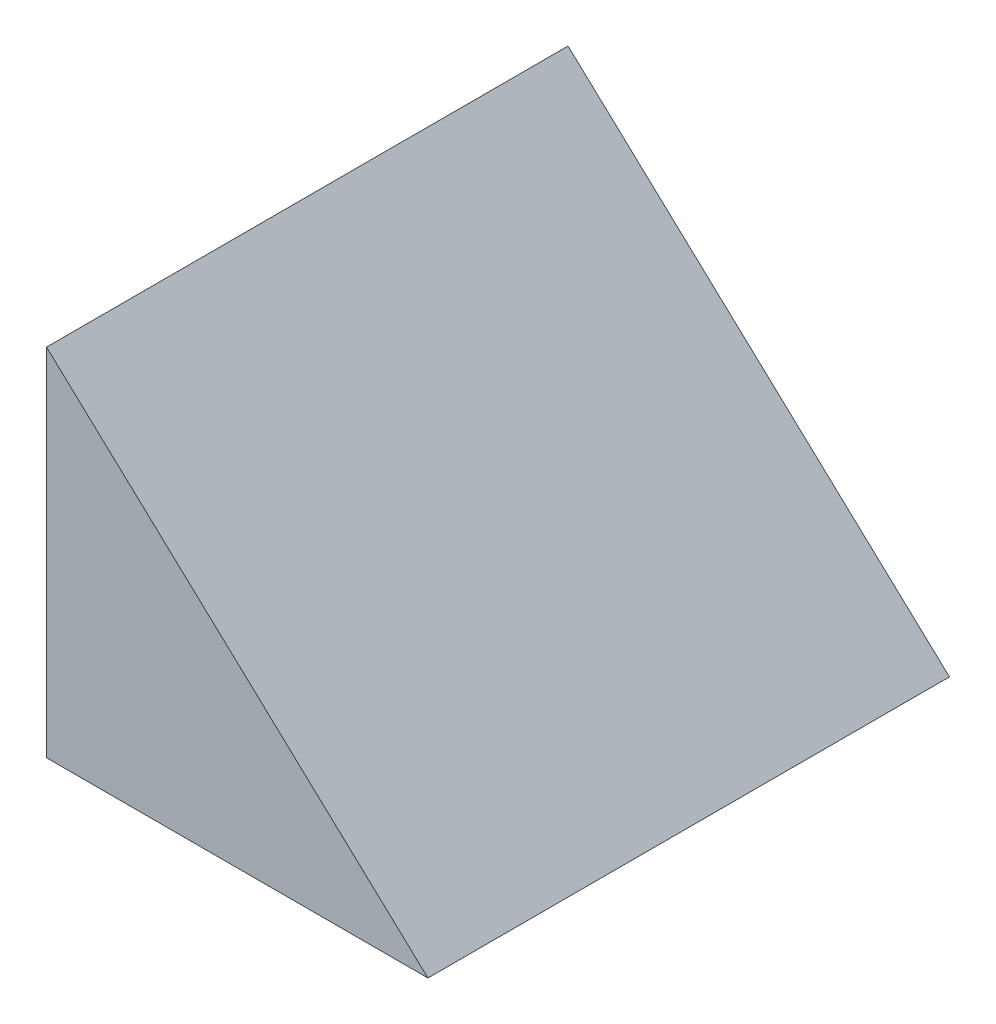
ISO-10303-21;
HEADER;
FILE_DESCRIPTION(('STEP AP214'),'2;1');
FILE_NAME('part.step','',(''),(''),'','','');
FILE_SCHEMA(('AUTOMOTIVE_DESIGN { 1 0 10303 214 1 1 1 1 }'));
ENDSEC;
DATA;
#1=APPLICATION_CONTEXT('core data for automotive mechanical design processes');
#2=APPLICATION_PROTOCOL_DEFINITION('international standard','automotive_design',2000,#1);
#3=PRODUCT_CONTEXT('',#1,'mechanical');
#4=PRODUCT('Part','Part','',(#3));
#5=PRODUCT_RELATED_PRODUCT_CATEGORY('part','',(#4));
#6=PRODUCT_DEFINITION_FORMATION('','',#4);
#7=PRODUCT_DEFINITION_CONTEXT('part definition',#1,'design');
#8=PRODUCT_DEFINITION('design','',#6,#7);
#9=PRODUCT_DEFINITION_SHAPE('','',#8);
#10=(LENGTH_UNIT() NAMED_UNIT(*) SI_UNIT(.MILLI.,.METRE.));
#11=(NAMED_UNIT(*) PLANE_ANGLE_UNIT() SI_UNIT($,.RADIAN.));
#12=(NAMED_UNIT(*) SI_UNIT($,.STERADIAN.) SOLID_ANGLE_UNIT());
#13=UNCERTAINTY_MEASURE_WITH_UNIT(LENGTH_MEASURE(1.E-05),#10,'distance_accuracy_value','');
#14=(GEOMETRIC_REPRESENTATION_CONTEXT(3) GLOBAL_UNCERTAINTY_ASSIGNED_CONTEXT((#13)) GLOBAL_UNIT_ASSIGNED_CONTEXT((#10,
#11,#12)) REPRESENTATION_CONTEXT('',''));
#15=CARTESIAN_POINT('',(0.,0.,0.));
#16=DIRECTION('',(0.,0.,1.));
#17=DIRECTION('',(1.,0.,0.));
#18=AXIS2_PLACEMENT_3D('',#15,#16,#17);
#19=CARTESIAN_POINT('',(0.,20.4599508018748,-30.));
#20=DIRECTION('',(-1.,0.,0.));
#21=DIRECTION('',(0.,-1.,0.));
#22=AXIS2_PLACEMENT_3D('',#19,#20,#21);
#23=PLANE('',#22);
#24=DIRECTION('',(0.,-1.,0.));
#25=VECTOR('',#24,1.);
#26=CARTESIAN_POINT('',(0.,0.,-28.5));
#27=LINE('',#26,#25);
#28=CARTESIAN_POINT('',(0.,13.5,-28.5));
#29=VERTEX_POINT('',#28);
#30=CARTESIAN_POINT('',(0.,0.,-28.5));
#31=VERTEX_POINT('',#30);
#32=EDGE_CURVE('E256',#29,#31,#27,.T.);
#33=ORIENTED_EDGE('',*,*,#32,.F.);
#34=DIRECTION('',(0.,0.,-1.));
#35=VECTOR('',#34,1.);
#36=CARTESIAN_POINT('',(0.,13.5,-28.5));
#37=LINE('',#36,#35);
#38=CARTESIAN_POINT('',(0.,13.5,-1.5));
#39=VERTEX_POINT('',#38);
#40=EDGE_CURVE('E254',#39,#29,#37,.T.);
#41=ORIENTED_EDGE('',*,*,#40,.F.);
#42=DIRECTION('',(0.,1.,0.));
#43=VECTOR('',#42,1.);
#44=CARTESIAN_POINT('',(0.,0.,-1.5));
#45=LINE('',#44,#43);
#46=CARTESIAN_POINT('',(0.,0.,-1.5));
#47=VERTEX_POINT('',#46);
#48=EDGE_CURVE('E153',#47,#39,#45,.T.);
#49=ORIENTED_EDGE('',*,*,#48,.F.);
#50=DIRECTION('',(0.,0.,1.));
#51=VECTOR('',#50,1.);
#52=CARTESIAN_POINT('',(0.,0.,-30.));
#53=LINE('',#52,#51);
#54=CARTESIAN_POINT('',(0.,0.,0.));
#55=VERTEX_POINT('',#54);
#56=EDGE_CURVE('E123',#47,#55,#53,.T.);
#57=ORIENTED_EDGE('',*,*,#56,.T.);
#58=DIRECTION('',(0.,-1.,0.));
#59=VECTOR('',#58,1.);
#60=CARTESIAN_POINT('',(0.,20.4599508018748,0.));
#61=LINE('',#60,#59);
#62=CARTESIAN_POINT('',(0.,20.4599508018748,0.));
#63=VERTEX_POINT('',#62);
#64=EDGE_CURVE('E134',#63,#55,#61,.T.);
#65=ORIENTED_EDGE('',*,*,#64,.F.);
#66=DIRECTION('',(0.,0.,1.));
#67=VECTOR('',#66,1.);
#68=CARTESIAN_POINT('',(0.,20.4599508018748,-30.));
#69=LINE('',#68,#67);
#70=CARTESIAN_POINT('',(0.,20.4599508018748,-30.));
#71=VERTEX_POINT('',#70);
#72=EDGE_CURVE('E11',#71,#63,#69,.T.);
#73=ORIENTED_EDGE('',*,*,#72,.F.);
#74=DIRECTION('',(0.,-1.,0.));
#75=VECTOR('',#74,1.);
#76=CARTESIAN_POINT('',(0.,20.4599508018748,-30.));
#77=LINE('',#76,#75);
#78=CARTESIAN_POINT('',(0.,0.,-30.));
#79=VERTEX_POINT('',#78);
#80=EDGE_CURVE('E138',#71,#79,#77,.T.);
#81=ORIENTED_EDGE('',*,*,#80,.T.);
#82=EDGE_CURVE('E40',#79,#31,#53,.T.);
#83=ORIENTED_EDGE('',*,*,#82,.T.);
#84=EDGE_LOOP('',(#33,#41,#49,#57,#65,#73,#81,#83));
#85=FACE_BOUND('',#84,.T.);
#86=ADVANCED_FACE('F37',(#85),#23,.T.);
#87=CARTESIAN_POINT('',(21.9406110485752,0.,-30.));
#88=DIRECTION('',(0.681998360062495,0.731353701619174,0.));
#89=DIRECTION('',(-0.731353701619174,0.681998360062495,0.));
#90=AXIS2_PLACEMENT_3D('',#87,#88,#89);
#91=PLANE('',#90);
#92=DIRECTION('',(-0.731353701619174,0.681998360062494,0.));
#93=VECTOR('',#92,1.);
#94=CARTESIAN_POINT('',(21.9406110485752,0.,0.));
#95=LINE('',#94,#93);
#96=CARTESIAN_POINT('',(21.9406110485752,0.,0.));
#97=VERTEX_POINT('',#96);
#98=EDGE_CURVE('E141',#97,#63,#95,.T.);
#99=ORIENTED_EDGE('',*,*,#98,.F.);
#100=DIRECTION('',(0.,0.,1.));
#101=VECTOR('',#100,1.);
#102=CARTESIAN_POINT('',(21.9406110485752,0.,-30.));
#103=LINE('',#102,#101);
#104=CARTESIAN_POINT('',(21.9406110485752,0.,-30.));
#105=VERTEX_POINT('',#104);
#106=EDGE_CURVE('E45',#105,#97,#103,.T.);
#107=ORIENTED_EDGE('',*,*,#106,.F.);
#108=DIRECTION('',(-0.731353701619174,0.681998360062494,0.));
#109=VECTOR('',#108,1.);
#110=CARTESIAN_POINT('',(21.9406110485752,0.,-30.));
#111=LINE('',#110,#109);
#112=EDGE_CURVE('E143',#105,#71,#111,.T.);
#113=ORIENTED_EDGE('',*,*,#112,.T.);
#114=ORIENTED_EDGE('',*,*,#72,.T.);
#115=EDGE_LOOP('',(#99,#107,#113,#114));
#116=FACE_BOUND('',#115,.T.);
#117=ADVANCED_FACE('F156',(#116),#91,.T.);
#118=CARTESIAN_POINT('',(0.,0.,-30.));
#119=DIRECTION('',(0.,-1.,0.));
#120=DIRECTION('',(0.,0.,-1.));
#121=AXIS2_PLACEMENT_3D('',#118,#119,#120);
#122=PLANE('',#121);
#123=DIRECTION('',(-1.,0.,0.));
#124=VECTOR('',#123,1.);
#125=CARTESIAN_POINT('',(6.,0.,-28.5));
#126=LINE('',#125,#124);
#127=CARTESIAN_POINT('',(6.,0.,-28.5));
#128=VERTEX_POINT('',#127);
#129=EDGE_CURVE('E124',#128,#31,#126,.T.);
#130=ORIENTED_EDGE('',*,*,#129,.T.);
#131=ORIENTED_EDGE('',*,*,#82,.F.);
#132=DIRECTION('',(1.,0.,0.));
#133=VECTOR('',#132,1.);
#134=CARTESIAN_POINT('',(0.,0.,-30.));
#135=LINE('',#134,#133);
#136=EDGE_CURVE('E140',#79,#105,#135,.T.);
#137=ORIENTED_EDGE('',*,*,#136,.T.);
#138=ORIENTED_EDGE('',*,*,#106,.T.);
#139=DIRECTION('',(1.,0.,0.));
#140=VECTOR('',#139,1.);
#141=CARTESIAN_POINT('',(0.,0.,0.));
#142=LINE('',#141,#140);
#143=EDGE_CURVE('E147',#55,#97,#142,.T.);
#144=ORIENTED_EDGE('',*,*,#143,.F.);
#145=ORIENTED_EDGE('',*,*,#56,.F.);
#146=DIRECTION('',(-1.,0.,0.));
#147=VECTOR('',#146,1.);
#148=CARTESIAN_POINT('',(6.,0.,-1.5));
#149=LINE('',#148,#147);
#150=CARTESIAN_POINT('',(6.,0.,-1.5));
#151=VERTEX_POINT('',#150);
#152=EDGE_CURVE('E109',#151,#47,#149,.T.);
#153=ORIENTED_EDGE('',*,*,#152,.F.);
#154=DIRECTION('',(0.,0.,1.));
#155=VECTOR('',#154,1.);
#156=CARTESIAN_POINT('',(6.,0.,-28.5));
#157=LINE('',#156,#155);
#158=EDGE_CURVE('E114',#128,#151,#157,.T.);
#159=ORIENTED_EDGE('',*,*,#158,.F.);
#160=EDGE_LOOP('',(#130,#131,#137,#138,#144,#145,#153,#159));
#161=FACE_BOUND('',#160,.T.);
#162=CARTESIAN_POINT('',(11.9406110485752,0.,-15.));
#163=DIRECTION('',(0.,-1.,0.));
#164=DIRECTION('',(0.,0.,-1.));
#165=AXIS2_PLACEMENT_3D('',#162,#163,#164);
#166=CIRCLE('',#165,1.49999999999999);
#167=CARTESIAN_POINT('',(11.9406110485752,0.,-16.5));
#168=VERTEX_POINT('',#167);
#169=EDGE_CURVE('E135',#168,#168,#166,.T.);
#170=ORIENTED_EDGE('',*,*,#169,.F.);
#171=EDGE_LOOP('',(#170));
#172=FACE_BOUND('',#171,.T.);
#173=ADVANCED_FACE('F120',(#161,#172),#122,.T.);
#174=CARTESIAN_POINT('',(0.,0.,-30.));
#175=DIRECTION('',(0.,0.,1.));
#176=DIRECTION('',(1.,0.,0.));
#177=AXIS2_PLACEMENT_3D('',#174,#175,#176);
#178=PLANE('',#177);
#179=ORIENTED_EDGE('',*,*,#80,.F.);
#180=ORIENTED_EDGE('',*,*,#112,.F.);
#181=ORIENTED_EDGE('',*,*,#136,.F.);
#182=EDGE_LOOP('',(#179,#180,#181));
#183=FACE_BOUND('',#182,.T.);
#184=ADVANCED_FACE('F159',(#183),#178,.F.);
#185=CARTESIAN_POINT('',(0.,0.,0.));
#186=DIRECTION('',(0.,0.,1.));
#187=DIRECTION('',(1.,0.,0.));
#188=AXIS2_PLACEMENT_3D('',#185,#186,#187);
#189=PLANE('',#188);
#190=ORIENTED_EDGE('',*,*,#64,.T.);
#191=ORIENTED_EDGE('',*,*,#143,.T.);
#192=ORIENTED_EDGE('',*,*,#98,.T.);
#193=EDGE_LOOP('',(#190,#191,#192));
#194=FACE_BOUND('',#193,.T.);
#195=ADVANCED_FACE('F155',(#194),#189,.T.);
#196=CARTESIAN_POINT('',(11.9406110485752,7.5,-15.));
#197=DIRECTION('',(0.,-1.,0.));
#198=DIRECTION('',(0.,0.,-1.));
#199=AXIS2_PLACEMENT_3D('',#196,#197,#198);
#200=CYLINDRICAL_SURFACE('',#199,1.49999999999999);
#201=CARTESIAN_POINT('',(11.9406110485752,7.5,-15.));
#202=DIRECTION('',(0.,-1.,0.));
#203=DIRECTION('',(0.,0.,-1.));
#204=AXIS2_PLACEMENT_3D('',#201,#202,#203);
#205=CIRCLE('',#204,1.49999999999999);
#206=CARTESIAN_POINT('',(11.9406110485752,7.5,-16.5));
#207=VERTEX_POINT('',#206);
#208=EDGE_CURVE('E131',#207,#207,#205,.T.);
#209=ORIENTED_EDGE('',*,*,#208,.F.);
#210=EDGE_LOOP('',(#209));
#211=FACE_BOUND('',#210,.T.);
#212=ORIENTED_EDGE('',*,*,#169,.T.);
#213=EDGE_LOOP('',(#212));
#214=FACE_BOUND('',#213,.T.);
#215=ADVANCED_FACE('F166',(#211,#214),#200,.F.);
#216=CARTESIAN_POINT('',(11.9406110485752,7.5,-15.));
#217=DIRECTION('',(0.,-1.,0.));
#218=DIRECTION('',(0.,0.,-1.));
#219=AXIS2_PLACEMENT_3D('',#216,#217,#218);
#220=PLANE('',#219);
#221=ORIENTED_EDGE('',*,*,#208,.T.);
#222=EDGE_LOOP('',(#221));
#223=FACE_BOUND('',#222,.T.);
#224=ADVANCED_FACE('F195',(#223),#220,.T.);
#225=CARTESIAN_POINT('',(6.,0.,-28.5));
#226=DIRECTION('',(0.,0.,-1.));
#227=DIRECTION('',(-1.,0.,0.));
#228=AXIS2_PLACEMENT_3D('',#225,#226,#227);
#229=PLANE('',#228);
#230=ORIENTED_EDGE('',*,*,#32,.T.);
#231=ORIENTED_EDGE('',*,*,#129,.F.);
#232=DIRECTION('',(0.,-1.,0.));
#233=VECTOR('',#232,1.);
#234=CARTESIAN_POINT('',(6.,0.,-28.5));
#235=LINE('',#234,#233);
#236=CARTESIAN_POINT('',(6.,13.5,-28.5));
#237=VERTEX_POINT('',#236);
#238=EDGE_CURVE('E53',#237,#128,#235,.T.);
#239=ORIENTED_EDGE('',*,*,#238,.F.);
#240=DIRECTION('',(-1.,0.,0.));
#241=VECTOR('',#240,1.);
#242=CARTESIAN_POINT('',(6.,13.5,-28.5));
#243=LINE('',#242,#241);
#244=EDGE_CURVE('E126',#237,#29,#243,.T.);
#245=ORIENTED_EDGE('',*,*,#244,.T.);
#246=EDGE_LOOP('',(#230,#231,#239,#245));
#247=FACE_BOUND('',#246,.T.);
#248=ADVANCED_FACE('F189',(#247),#229,.F.);
#249=CARTESIAN_POINT('',(6.,13.5,-28.5));
#250=DIRECTION('',(0.,1.,0.));
#251=DIRECTION('',(-1.,0.,0.));
#252=AXIS2_PLACEMENT_3D('',#249,#250,#251);
#253=PLANE('',#252);
#254=ORIENTED_EDGE('',*,*,#40,.T.);
#255=ORIENTED_EDGE('',*,*,#244,.F.);
#256=DIRECTION('',(0.,0.,-1.));
#257=VECTOR('',#256,1.);
#258=CARTESIAN_POINT('',(6.,13.5,-28.5));
#259=LINE('',#258,#257);
#260=CARTESIAN_POINT('',(6.,13.5,-1.5));
#261=VERTEX_POINT('',#260);
#262=EDGE_CURVE('E113',#261,#237,#259,.T.);
#263=ORIENTED_EDGE('',*,*,#262,.F.);
#264=DIRECTION('',(-1.,0.,0.));
#265=VECTOR('',#264,1.);
#266=CARTESIAN_POINT('',(6.,13.5,-1.5));
#267=LINE('',#266,#265);
#268=EDGE_CURVE('E111',#261,#39,#267,.T.);
#269=ORIENTED_EDGE('',*,*,#268,.T.);
#270=EDGE_LOOP('',(#254,#255,#263,#269));
#271=FACE_BOUND('',#270,.T.);
#272=ADVANCED_FACE('F194',(#271),#253,.F.);
#273=CARTESIAN_POINT('',(6.,0.,-1.5));
#274=DIRECTION('',(0.,0.,1.));
#275=DIRECTION('',(0.,-1.,0.));
#276=AXIS2_PLACEMENT_3D('',#273,#274,#275);
#277=PLANE('',#276);
#278=ORIENTED_EDGE('',*,*,#48,.T.);
#279=ORIENTED_EDGE('',*,*,#268,.F.);
#280=DIRECTION('',(0.,1.,0.));
#281=VECTOR('',#280,1.);
#282=CARTESIAN_POINT('',(6.,0.,-1.5));
#283=LINE('',#282,#281);
#284=EDGE_CURVE('E105',#151,#261,#283,.T.);
#285=ORIENTED_EDGE('',*,*,#284,.F.);
#286=ORIENTED_EDGE('',*,*,#152,.T.);
#287=EDGE_LOOP('',(#278,#279,#285,#286));
#288=FACE_BOUND('',#287,.T.);
#289=ADVANCED_FACE('F107',(#288),#277,.F.);
#290=CARTESIAN_POINT('',(6.,0.,0.));
#291=DIRECTION('',(1.,0.,0.));
#292=DIRECTION('',(0.,1.,0.));
#293=AXIS2_PLACEMENT_3D('',#290,#291,#292);
#294=PLANE('',#293);
#295=ORIENTED_EDGE('',*,*,#238,.T.);
#296=ORIENTED_EDGE('',*,*,#158,.T.);
#297=ORIENTED_EDGE('',*,*,#284,.T.);
#298=ORIENTED_EDGE('',*,*,#262,.T.);
#299=EDGE_LOOP('',(#295,#296,#297,#298));
#300=FACE_BOUND('',#299,.T.);
#301=ADVANCED_FACE('F117',(#300),#294,.F.);
#302=CLOSED_SHELL('',(#86,#117,#173,#184,#195,#215,#224,#248,#272,#289,#301));
#303=MANIFOLD_SOLID_BREP('B2',#302);
#304=ADVANCED_BREP_SHAPE_REPRESENTATION('',(#18,#303),#14);
#305=SHAPE_DEFINITION_REPRESENTATION(#9,#304);
ENDSEC;
END-ISO-10303-21;
